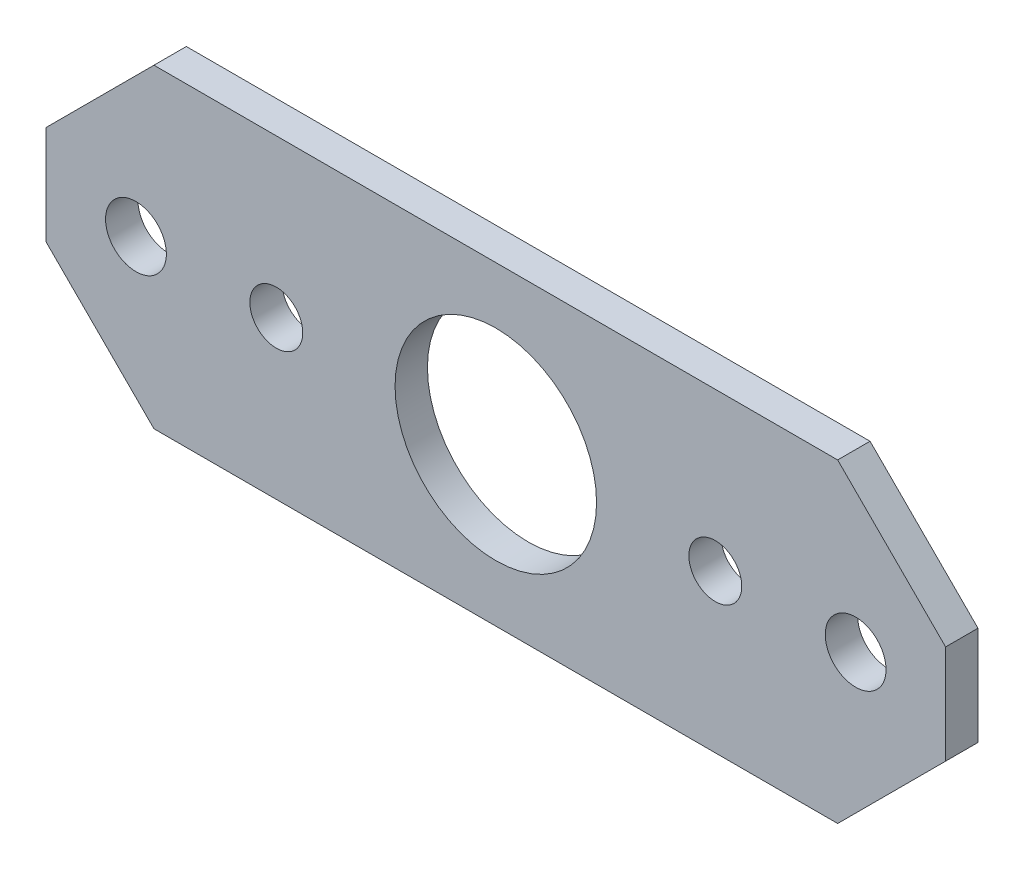
ISO-10303-21;
HEADER;
FILE_DESCRIPTION(('STEP AP214'),'2;1');
FILE_NAME('part.step','',(''),(''),'','','');
FILE_SCHEMA(('AUTOMOTIVE_DESIGN { 1 0 10303 214 1 1 1 1 }'));
ENDSEC;
DATA;
#1=APPLICATION_CONTEXT('core data for automotive mechanical design processes');
#2=APPLICATION_PROTOCOL_DEFINITION('international standard','automotive_design',2000,#1);
#3=PRODUCT_CONTEXT('',#1,'mechanical');
#4=PRODUCT('Part','Part','',(#3));
#5=PRODUCT_RELATED_PRODUCT_CATEGORY('part','',(#4));
#6=PRODUCT_DEFINITION_FORMATION('','',#4);
#7=PRODUCT_DEFINITION_CONTEXT('part definition',#1,'design');
#8=PRODUCT_DEFINITION('design','',#6,#7);
#9=PRODUCT_DEFINITION_SHAPE('','',#8);
#10=(LENGTH_UNIT() NAMED_UNIT(*) SI_UNIT(.MILLI.,.METRE.));
#11=(NAMED_UNIT(*) PLANE_ANGLE_UNIT() SI_UNIT($,.RADIAN.));
#12=(NAMED_UNIT(*) SI_UNIT($,.STERADIAN.) SOLID_ANGLE_UNIT());
#13=UNCERTAINTY_MEASURE_WITH_UNIT(LENGTH_MEASURE(1.E-05),#10,'distance_accuracy_value','');
#14=(GEOMETRIC_REPRESENTATION_CONTEXT(3) GLOBAL_UNCERTAINTY_ASSIGNED_CONTEXT((#13)) GLOBAL_UNIT_ASSIGNED_CONTEXT((#10,
#11,#12)) REPRESENTATION_CONTEXT('',''));
#15=CARTESIAN_POINT('',(0.,0.,0.));
#16=DIRECTION('',(0.,0.,1.));
#17=DIRECTION('',(1.,0.,0.));
#18=AXIS2_PLACEMENT_3D('',#15,#16,#17);
#19=CARTESIAN_POINT('',(-31.75,-11.1125,0.));
#20=DIRECTION('',(0.,0.,1.));
#21=DIRECTION('',(1.,0.,0.));
#22=AXIS2_PLACEMENT_3D('',#19,#20,#21);
#23=PLANE('',#22);
#24=DIRECTION('',(-0.707106781186548,0.707106781186548,0.));
#25=VECTOR('',#24,1.);
#26=CARTESIAN_POINT('',(-24.13,-11.1125,0.));
#27=LINE('',#26,#25);
#28=CARTESIAN_POINT('',(-24.13,-11.1125,0.));
#29=VERTEX_POINT('',#28);
#30=CARTESIAN_POINT('',(-31.75,-3.4925,0.));
#31=VERTEX_POINT('',#30);
#32=EDGE_CURVE('E82',#29,#31,#27,.T.);
#33=ORIENTED_EDGE('',*,*,#32,.T.);
#34=DIRECTION('',(0.,1.,0.));
#35=VECTOR('',#34,1.);
#36=CARTESIAN_POINT('',(-31.75,11.1125,0.));
#37=LINE('',#36,#35);
#38=CARTESIAN_POINT('',(-31.75,3.4925,0.));
#39=VERTEX_POINT('',#38);
#40=EDGE_CURVE('E85',#31,#39,#37,.T.);
#41=ORIENTED_EDGE('',*,*,#40,.T.);
#42=DIRECTION('',(0.707106781186547,0.707106781186548,0.));
#43=VECTOR('',#42,1.);
#44=CARTESIAN_POINT('',(-31.75,3.4925,0.));
#45=LINE('',#44,#43);
#46=CARTESIAN_POINT('',(-24.13,11.1125,0.));
#47=VERTEX_POINT('',#46);
#48=EDGE_CURVE('E349',#39,#47,#45,.T.);
#49=ORIENTED_EDGE('',*,*,#48,.T.);
#50=DIRECTION('',(1.,0.,0.));
#51=VECTOR('',#50,1.);
#52=CARTESIAN_POINT('',(-31.75,11.1125,0.));
#53=LINE('',#52,#51);
#54=CARTESIAN_POINT('',(24.13,11.1125,0.));
#55=VERTEX_POINT('',#54);
#56=EDGE_CURVE('E344',#47,#55,#53,.T.);
#57=ORIENTED_EDGE('',*,*,#56,.T.);
#58=DIRECTION('',(0.707106781186548,-0.707106781186547,0.));
#59=VECTOR('',#58,1.);
#60=CARTESIAN_POINT('',(24.13,11.1125,0.));
#61=LINE('',#60,#59);
#62=CARTESIAN_POINT('',(31.75,3.4925,0.));
#63=VERTEX_POINT('',#62);
#64=EDGE_CURVE('E340',#55,#63,#61,.T.);
#65=ORIENTED_EDGE('',*,*,#64,.T.);
#66=DIRECTION('',(0.,1.,0.));
#67=VECTOR('',#66,1.);
#68=CARTESIAN_POINT('',(31.75,11.1125,0.));
#69=LINE('',#68,#67);
#70=CARTESIAN_POINT('',(31.75,-3.4925,0.));
#71=VERTEX_POINT('',#70);
#72=EDGE_CURVE('E336',#63,#71,#69,.F.);
#73=ORIENTED_EDGE('',*,*,#72,.T.);
#74=DIRECTION('',(-0.707106781186548,-0.707106781186547,0.));
#75=VECTOR('',#74,1.);
#76=CARTESIAN_POINT('',(31.75,-3.4925,0.));
#77=LINE('',#76,#75);
#78=CARTESIAN_POINT('',(24.13,-11.1125,0.));
#79=VERTEX_POINT('',#78);
#80=EDGE_CURVE('E331',#71,#79,#77,.T.);
#81=ORIENTED_EDGE('',*,*,#80,.T.);
#82=DIRECTION('',(1.,0.,0.));
#83=VECTOR('',#82,1.);
#84=CARTESIAN_POINT('',(-31.75,-11.1125,0.));
#85=LINE('',#84,#83);
#86=EDGE_CURVE('E80',#79,#29,#85,.F.);
#87=ORIENTED_EDGE('',*,*,#86,.T.);
#88=EDGE_LOOP('',(#33,#41,#49,#57,#65,#73,#81,#87));
#89=FACE_BOUND('',#88,.T.);
#90=CARTESIAN_POINT('',(0.,0.,0.));
#91=DIRECTION('',(0.,0.,-1.));
#92=DIRECTION('',(-1.,0.,0.));
#93=AXIS2_PLACEMENT_3D('',#90,#91,#92);
#94=CIRCLE('',#93,7.112);
#95=CARTESIAN_POINT('',(-7.112,0.,0.));
#96=VERTEX_POINT('',#95);
#97=EDGE_CURVE('E98',#96,#96,#94,.F.);
#98=ORIENTED_EDGE('',*,*,#97,.T.);
#99=EDGE_LOOP('',(#98));
#100=FACE_BOUND('',#99,.T.);
#101=CARTESIAN_POINT('',(25.4,0.,0.));
#102=DIRECTION('',(0.,0.,-1.));
#103=DIRECTION('',(-1.,0.,0.));
#104=AXIS2_PLACEMENT_3D('',#101,#102,#103);
#105=CIRCLE('',#104,2.1463);
#106=CARTESIAN_POINT('',(23.2537,0.,0.));
#107=VERTEX_POINT('',#106);
#108=EDGE_CURVE('E127',#107,#107,#105,.F.);
#109=ORIENTED_EDGE('',*,*,#108,.T.);
#110=EDGE_LOOP('',(#109));
#111=FACE_BOUND('',#110,.T.);
#112=CARTESIAN_POINT('',(-25.4,0.,0.));
#113=DIRECTION('',(0.,0.,-1.));
#114=DIRECTION('',(-1.,0.,0.));
#115=AXIS2_PLACEMENT_3D('',#112,#113,#114);
#116=CIRCLE('',#115,2.1463);
#117=CARTESIAN_POINT('',(-27.5463,0.,0.));
#118=VERTEX_POINT('',#117);
#119=EDGE_CURVE('E130',#118,#118,#116,.F.);
#120=ORIENTED_EDGE('',*,*,#119,.T.);
#121=EDGE_LOOP('',(#120));
#122=FACE_BOUND('',#121,.T.);
#123=CARTESIAN_POINT('',(15.494,0.,0.));
#124=DIRECTION('',(0.,0.,-1.));
#125=DIRECTION('',(-1.,0.,0.));
#126=AXIS2_PLACEMENT_3D('',#123,#124,#125);
#127=CIRCLE('',#126,1.8669);
#128=CARTESIAN_POINT('',(13.6271,0.,0.));
#129=VERTEX_POINT('',#128);
#130=EDGE_CURVE('E132',#129,#129,#127,.F.);
#131=ORIENTED_EDGE('',*,*,#130,.T.);
#132=EDGE_LOOP('',(#131));
#133=FACE_BOUND('',#132,.T.);
#134=CARTESIAN_POINT('',(-15.494,0.,0.));
#135=DIRECTION('',(0.,0.,-1.));
#136=DIRECTION('',(-1.,0.,0.));
#137=AXIS2_PLACEMENT_3D('',#134,#135,#136);
#138=CIRCLE('',#137,1.8669);
#139=CARTESIAN_POINT('',(-17.3609,0.,0.));
#140=VERTEX_POINT('',#139);
#141=EDGE_CURVE('E20',#140,#140,#138,.F.);
#142=ORIENTED_EDGE('',*,*,#141,.T.);
#143=EDGE_LOOP('',(#142));
#144=FACE_BOUND('',#143,.T.);
#145=ADVANCED_FACE('F17',(#89,#100,#111,#122,#133,#144),#23,.F.);
#146=CARTESIAN_POINT('',(-15.494,0.,2.286));
#147=DIRECTION('',(0.,0.,-1.));
#148=DIRECTION('',(-1.,0.,0.));
#149=AXIS2_PLACEMENT_3D('',#146,#147,#148);
#150=CYLINDRICAL_SURFACE('',#149,1.8669);
#151=ORIENTED_EDGE('',*,*,#141,.F.);
#152=EDGE_LOOP('',(#151));
#153=FACE_BOUND('',#152,.T.);
#154=CARTESIAN_POINT('',(-15.494,0.,2.286));
#155=DIRECTION('',(0.,0.,-1.));
#156=DIRECTION('',(-1.,0.,0.));
#157=AXIS2_PLACEMENT_3D('',#154,#155,#156);
#158=CIRCLE('',#157,1.8669);
#159=CARTESIAN_POINT('',(-17.3609,0.,2.286));
#160=VERTEX_POINT('',#159);
#161=EDGE_CURVE('E122',#160,#160,#158,.T.);
#162=ORIENTED_EDGE('',*,*,#161,.F.);
#163=EDGE_LOOP('',(#162));
#164=FACE_BOUND('',#163,.T.);
#165=ADVANCED_FACE('F140',(#153,#164),#150,.F.);
#166=CARTESIAN_POINT('',(15.494,0.,2.286));
#167=DIRECTION('',(0.,0.,-1.));
#168=DIRECTION('',(-1.,0.,0.));
#169=AXIS2_PLACEMENT_3D('',#166,#167,#168);
#170=CYLINDRICAL_SURFACE('',#169,1.8669);
#171=ORIENTED_EDGE('',*,*,#130,.F.);
#172=EDGE_LOOP('',(#171));
#173=FACE_BOUND('',#172,.T.);
#174=CARTESIAN_POINT('',(15.494,0.,2.286));
#175=DIRECTION('',(0.,0.,-1.));
#176=DIRECTION('',(-1.,0.,0.));
#177=AXIS2_PLACEMENT_3D('',#174,#175,#176);
#178=CIRCLE('',#177,1.8669);
#179=CARTESIAN_POINT('',(13.6271,0.,2.286));
#180=VERTEX_POINT('',#179);
#181=EDGE_CURVE('E119',#180,#180,#178,.T.);
#182=ORIENTED_EDGE('',*,*,#181,.F.);
#183=EDGE_LOOP('',(#182));
#184=FACE_BOUND('',#183,.T.);
#185=ADVANCED_FACE('F143',(#173,#184),#170,.F.);
#186=CARTESIAN_POINT('',(-25.4,0.,2.286));
#187=DIRECTION('',(0.,0.,-1.));
#188=DIRECTION('',(-1.,0.,0.));
#189=AXIS2_PLACEMENT_3D('',#186,#187,#188);
#190=CYLINDRICAL_SURFACE('',#189,2.1463);
#191=ORIENTED_EDGE('',*,*,#119,.F.);
#192=EDGE_LOOP('',(#191));
#193=FACE_BOUND('',#192,.T.);
#194=CARTESIAN_POINT('',(-25.4,0.,2.286));
#195=DIRECTION('',(0.,0.,-1.));
#196=DIRECTION('',(-1.,0.,0.));
#197=AXIS2_PLACEMENT_3D('',#194,#195,#196);
#198=CIRCLE('',#197,2.1463);
#199=CARTESIAN_POINT('',(-27.5463,0.,2.286));
#200=VERTEX_POINT('',#199);
#201=EDGE_CURVE('E116',#200,#200,#198,.T.);
#202=ORIENTED_EDGE('',*,*,#201,.F.);
#203=EDGE_LOOP('',(#202));
#204=FACE_BOUND('',#203,.T.);
#205=ADVANCED_FACE('F190',(#193,#204),#190,.F.);
#206=CARTESIAN_POINT('',(25.4,0.,2.286));
#207=DIRECTION('',(0.,0.,-1.));
#208=DIRECTION('',(-1.,0.,0.));
#209=AXIS2_PLACEMENT_3D('',#206,#207,#208);
#210=CYLINDRICAL_SURFACE('',#209,2.1463);
#211=ORIENTED_EDGE('',*,*,#108,.F.);
#212=EDGE_LOOP('',(#211));
#213=FACE_BOUND('',#212,.T.);
#214=CARTESIAN_POINT('',(25.4,0.,2.286));
#215=DIRECTION('',(0.,0.,-1.));
#216=DIRECTION('',(-1.,0.,0.));
#217=AXIS2_PLACEMENT_3D('',#214,#215,#216);
#218=CIRCLE('',#217,2.1463);
#219=CARTESIAN_POINT('',(23.2537,0.,2.286));
#220=VERTEX_POINT('',#219);
#221=EDGE_CURVE('E113',#220,#220,#218,.T.);
#222=ORIENTED_EDGE('',*,*,#221,.F.);
#223=EDGE_LOOP('',(#222));
#224=FACE_BOUND('',#223,.T.);
#225=ADVANCED_FACE('F186',(#213,#224),#210,.F.);
#226=CARTESIAN_POINT('',(0.,0.,2.286));
#227=DIRECTION('',(0.,0.,-1.));
#228=DIRECTION('',(-1.,0.,0.));
#229=AXIS2_PLACEMENT_3D('',#226,#227,#228);
#230=CYLINDRICAL_SURFACE('',#229,7.112);
#231=ORIENTED_EDGE('',*,*,#97,.F.);
#232=EDGE_LOOP('',(#231));
#233=FACE_BOUND('',#232,.T.);
#234=CARTESIAN_POINT('',(0.,0.,2.286));
#235=DIRECTION('',(0.,0.,-1.));
#236=DIRECTION('',(-1.,0.,0.));
#237=AXIS2_PLACEMENT_3D('',#234,#235,#236);
#238=CIRCLE('',#237,7.112);
#239=CARTESIAN_POINT('',(-7.112,0.,2.286));
#240=VERTEX_POINT('',#239);
#241=EDGE_CURVE('E109',#240,#240,#238,.T.);
#242=ORIENTED_EDGE('',*,*,#241,.F.);
#243=EDGE_LOOP('',(#242));
#244=FACE_BOUND('',#243,.T.);
#245=ADVANCED_FACE('F183',(#233,#244),#230,.F.);
#246=CARTESIAN_POINT('',(-31.75,11.1125,2.286));
#247=DIRECTION('',(1.,0.,0.));
#248=DIRECTION('',(0.,0.,-1.));
#249=AXIS2_PLACEMENT_3D('',#246,#247,#248);
#250=PLANE('',#249);
#251=DIRECTION('',(0.,0.,1.));
#252=VECTOR('',#251,1.);
#253=CARTESIAN_POINT('',(-31.75,-3.4925,2.286));
#254=LINE('',#253,#252);
#255=CARTESIAN_POINT('',(-31.75,-3.4925,2.286));
#256=VERTEX_POINT('',#255);
#257=EDGE_CURVE('E90',#31,#256,#254,.T.);
#258=ORIENTED_EDGE('',*,*,#257,.T.);
#259=DIRECTION('',(0.,1.,0.));
#260=VECTOR('',#259,1.);
#261=CARTESIAN_POINT('',(-31.75,-11.1125,2.286));
#262=LINE('',#261,#260);
#263=CARTESIAN_POINT('',(-31.75,3.4925,2.286));
#264=VERTEX_POINT('',#263);
#265=EDGE_CURVE('E112',#264,#256,#262,.F.);
#266=ORIENTED_EDGE('',*,*,#265,.F.);
#267=DIRECTION('',(0.,0.,1.));
#268=VECTOR('',#267,1.);
#269=CARTESIAN_POINT('',(-31.75,3.4925,2.286));
#270=LINE('',#269,#268);
#271=EDGE_CURVE('E96',#264,#39,#270,.F.);
#272=ORIENTED_EDGE('',*,*,#271,.T.);
#273=ORIENTED_EDGE('',*,*,#40,.F.);
#274=EDGE_LOOP('',(#258,#266,#272,#273));
#275=FACE_BOUND('',#274,.T.);
#276=ADVANCED_FACE('F93',(#275),#250,.F.);
#277=CARTESIAN_POINT('',(-24.13,-11.1125,2.286));
#278=DIRECTION('',(0.707106781186548,0.707106781186548,0.));
#279=DIRECTION('',(-0.707106781186548,0.707106781186548,0.));
#280=AXIS2_PLACEMENT_3D('',#277,#278,#279);
#281=PLANE('',#280);
#282=ORIENTED_EDGE('',*,*,#257,.F.);
#283=ORIENTED_EDGE('',*,*,#32,.F.);
#284=DIRECTION('',(0.,0.,1.));
#285=VECTOR('',#284,1.);
#286=CARTESIAN_POINT('',(-24.13,-11.1125,2.286));
#287=LINE('',#286,#285);
#288=CARTESIAN_POINT('',(-24.13,-11.1125,2.286));
#289=VERTEX_POINT('',#288);
#290=EDGE_CURVE('E105',#29,#289,#287,.T.);
#291=ORIENTED_EDGE('',*,*,#290,.T.);
#292=DIRECTION('',(0.707106781186547,-0.707106781186548,0.));
#293=VECTOR('',#292,1.);
#294=CARTESIAN_POINT('',(-31.75,-3.49249999999999,2.286));
#295=LINE('',#294,#293);
#296=EDGE_CURVE('E102',#256,#289,#295,.T.);
#297=ORIENTED_EDGE('',*,*,#296,.F.);
#298=EDGE_LOOP('',(#282,#283,#291,#297));
#299=FACE_BOUND('',#298,.T.);
#300=ADVANCED_FACE('F100',(#299),#281,.F.);
#301=CARTESIAN_POINT('',(-31.75,-11.1125,2.286));
#302=DIRECTION('',(0.,1.,0.));
#303=DIRECTION('',(0.,0.,1.));
#304=AXIS2_PLACEMENT_3D('',#301,#302,#303);
#305=PLANE('',#304);
#306=ORIENTED_EDGE('',*,*,#290,.F.);
#307=ORIENTED_EDGE('',*,*,#86,.F.);
#308=DIRECTION('',(0.,0.,1.));
#309=VECTOR('',#308,1.);
#310=CARTESIAN_POINT('',(24.13,-11.1125,2.286));
#311=LINE('',#310,#309);
#312=CARTESIAN_POINT('',(24.13,-11.1125,2.286));
#313=VERTEX_POINT('',#312);
#314=EDGE_CURVE('E332',#79,#313,#311,.T.);
#315=ORIENTED_EDGE('',*,*,#314,.T.);
#316=DIRECTION('',(1.,0.,0.));
#317=VECTOR('',#316,1.);
#318=CARTESIAN_POINT('',(-31.75,-11.1125,2.286));
#319=LINE('',#318,#317);
#320=EDGE_CURVE('E330',#289,#313,#319,.T.);
#321=ORIENTED_EDGE('',*,*,#320,.F.);
#322=EDGE_LOOP('',(#306,#307,#315,#321));
#323=FACE_BOUND('',#322,.T.);
#324=ADVANCED_FACE('F174',(#323),#305,.F.);
#325=CARTESIAN_POINT('',(31.75,-3.4925,2.286));
#326=DIRECTION('',(-0.707106781186547,0.707106781186548,0.));
#327=DIRECTION('',(-0.707106781186548,-0.707106781186547,0.));
#328=AXIS2_PLACEMENT_3D('',#325,#326,#327);
#329=PLANE('',#328);
#330=ORIENTED_EDGE('',*,*,#314,.F.);
#331=ORIENTED_EDGE('',*,*,#80,.F.);
#332=DIRECTION('',(0.,0.,1.));
#333=VECTOR('',#332,1.);
#334=CARTESIAN_POINT('',(31.75,-3.4925,2.286));
#335=LINE('',#334,#333);
#336=CARTESIAN_POINT('',(31.75,-3.4925,2.286));
#337=VERTEX_POINT('',#336);
#338=EDGE_CURVE('E338',#71,#337,#335,.T.);
#339=ORIENTED_EDGE('',*,*,#338,.T.);
#340=DIRECTION('',(0.707106781186548,0.707106781186547,0.));
#341=VECTOR('',#340,1.);
#342=CARTESIAN_POINT('',(24.13,-11.1125,2.286));
#343=LINE('',#342,#341);
#344=EDGE_CURVE('E355',#313,#337,#343,.T.);
#345=ORIENTED_EDGE('',*,*,#344,.F.);
#346=EDGE_LOOP('',(#330,#331,#339,#345));
#347=FACE_BOUND('',#346,.T.);
#348=ADVANCED_FACE('F170',(#347),#329,.F.);
#349=CARTESIAN_POINT('',(31.75,11.1125,2.286));
#350=DIRECTION('',(-1.,0.,0.));
#351=DIRECTION('',(0.,0.,1.));
#352=AXIS2_PLACEMENT_3D('',#349,#350,#351);
#353=PLANE('',#352);
#354=ORIENTED_EDGE('',*,*,#338,.F.);
#355=ORIENTED_EDGE('',*,*,#72,.F.);
#356=DIRECTION('',(0.,0.,1.));
#357=VECTOR('',#356,1.);
#358=CARTESIAN_POINT('',(31.75,3.4925,2.286));
#359=LINE('',#358,#357);
#360=CARTESIAN_POINT('',(31.75,3.4925,2.286));
#361=VERTEX_POINT('',#360);
#362=EDGE_CURVE('E342',#63,#361,#359,.T.);
#363=ORIENTED_EDGE('',*,*,#362,.T.);
#364=DIRECTION('',(0.,1.,0.));
#365=VECTOR('',#364,1.);
#366=CARTESIAN_POINT('',(31.75,-11.1125,2.286));
#367=LINE('',#366,#365);
#368=EDGE_CURVE('E358',#337,#361,#367,.T.);
#369=ORIENTED_EDGE('',*,*,#368,.F.);
#370=EDGE_LOOP('',(#354,#355,#363,#369));
#371=FACE_BOUND('',#370,.T.);
#372=ADVANCED_FACE('F166',(#371),#353,.F.);
#373=CARTESIAN_POINT('',(24.13,11.1125,2.286));
#374=DIRECTION('',(-0.707106781186547,-0.707106781186548,0.));
#375=DIRECTION('',(0.707106781186548,-0.707106781186547,0.));
#376=AXIS2_PLACEMENT_3D('',#373,#374,#375);
#377=PLANE('',#376);
#378=ORIENTED_EDGE('',*,*,#362,.F.);
#379=ORIENTED_EDGE('',*,*,#64,.F.);
#380=DIRECTION('',(0.,0.,-1.));
#381=VECTOR('',#380,1.);
#382=CARTESIAN_POINT('',(24.13,11.1125,2.286));
#383=LINE('',#382,#381);
#384=CARTESIAN_POINT('',(24.13,11.1125,2.286));
#385=VERTEX_POINT('',#384);
#386=EDGE_CURVE('E346',#55,#385,#383,.F.);
#387=ORIENTED_EDGE('',*,*,#386,.T.);
#388=DIRECTION('',(-0.707106781186547,0.707106781186547,0.));
#389=VECTOR('',#388,1.);
#390=CARTESIAN_POINT('',(31.75,3.49249999999999,2.286));
#391=LINE('',#390,#389);
#392=EDGE_CURVE('E361',#361,#385,#391,.T.);
#393=ORIENTED_EDGE('',*,*,#392,.F.);
#394=EDGE_LOOP('',(#378,#379,#387,#393));
#395=FACE_BOUND('',#394,.T.);
#396=ADVANCED_FACE('F163',(#395),#377,.F.);
#397=CARTESIAN_POINT('',(-31.75,11.1125,2.286));
#398=DIRECTION('',(0.,-1.,0.));
#399=DIRECTION('',(0.,0.,-1.));
#400=AXIS2_PLACEMENT_3D('',#397,#398,#399);
#401=PLANE('',#400);
#402=ORIENTED_EDGE('',*,*,#386,.F.);
#403=ORIENTED_EDGE('',*,*,#56,.F.);
#404=DIRECTION('',(0.,0.,1.));
#405=VECTOR('',#404,1.);
#406=CARTESIAN_POINT('',(-24.13,11.1125,2.286));
#407=LINE('',#406,#405);
#408=CARTESIAN_POINT('',(-24.13,11.1125,2.286));
#409=VERTEX_POINT('',#408);
#410=EDGE_CURVE('E35',#47,#409,#407,.T.);
#411=ORIENTED_EDGE('',*,*,#410,.T.);
#412=DIRECTION('',(1.,0.,0.));
#413=VECTOR('',#412,1.);
#414=CARTESIAN_POINT('',(-31.75,11.1125,2.286));
#415=LINE('',#414,#413);
#416=EDGE_CURVE('E26',#385,#409,#415,.F.);
#417=ORIENTED_EDGE('',*,*,#416,.F.);
#418=EDGE_LOOP('',(#402,#403,#411,#417));
#419=FACE_BOUND('',#418,.T.);
#420=ADVANCED_FACE('F155',(#419),#401,.F.);
#421=CARTESIAN_POINT('',(-31.75,3.4925,2.286));
#422=DIRECTION('',(0.707106781186548,-0.707106781186547,0.));
#423=DIRECTION('',(0.707106781186547,0.707106781186548,0.));
#424=AXIS2_PLACEMENT_3D('',#421,#422,#423);
#425=PLANE('',#424);
#426=ORIENTED_EDGE('',*,*,#410,.F.);
#427=ORIENTED_EDGE('',*,*,#48,.F.);
#428=ORIENTED_EDGE('',*,*,#271,.F.);
#429=DIRECTION('',(-0.707106781186547,-0.707106781186548,0.));
#430=VECTOR('',#429,1.);
#431=CARTESIAN_POINT('',(-24.13,11.1125,2.286));
#432=LINE('',#431,#430);
#433=EDGE_CURVE('E11',#409,#264,#432,.T.);
#434=ORIENTED_EDGE('',*,*,#433,.F.);
#435=EDGE_LOOP('',(#426,#427,#428,#434));
#436=FACE_BOUND('',#435,.T.);
#437=ADVANCED_FACE('F148',(#436),#425,.F.);
#438=CARTESIAN_POINT('',(-31.75,-11.1125,2.286));
#439=DIRECTION('',(0.,0.,1.));
#440=DIRECTION('',(1.,0.,0.));
#441=AXIS2_PLACEMENT_3D('',#438,#439,#440);
#442=PLANE('',#441);
#443=ORIENTED_EDGE('',*,*,#416,.T.);
#444=ORIENTED_EDGE('',*,*,#433,.T.);
#445=ORIENTED_EDGE('',*,*,#265,.T.);
#446=ORIENTED_EDGE('',*,*,#296,.T.);
#447=ORIENTED_EDGE('',*,*,#320,.T.);
#448=ORIENTED_EDGE('',*,*,#344,.T.);
#449=ORIENTED_EDGE('',*,*,#368,.T.);
#450=ORIENTED_EDGE('',*,*,#392,.T.);
#451=EDGE_LOOP('',(#443,#444,#445,#446,#447,#448,#449,#450));
#452=FACE_BOUND('',#451,.T.);
#453=ORIENTED_EDGE('',*,*,#241,.T.);
#454=EDGE_LOOP('',(#453));
#455=FACE_BOUND('',#454,.T.);
#456=ORIENTED_EDGE('',*,*,#221,.T.);
#457=EDGE_LOOP('',(#456));
#458=FACE_BOUND('',#457,.T.);
#459=ORIENTED_EDGE('',*,*,#201,.T.);
#460=EDGE_LOOP('',(#459));
#461=FACE_BOUND('',#460,.T.);
#462=ORIENTED_EDGE('',*,*,#181,.T.);
#463=EDGE_LOOP('',(#462));
#464=FACE_BOUND('',#463,.T.);
#465=ORIENTED_EDGE('',*,*,#161,.T.);
#466=EDGE_LOOP('',(#465));
#467=FACE_BOUND('',#466,.T.);
#468=ADVANCED_FACE('F146',(#452,#455,#458,#461,#464,#467),#442,.T.);
#469=CLOSED_SHELL('',(#145,#165,#185,#205,#225,#245,#276,#300,#324,#348,#372,#396,#420,#437,#468));
#470=MANIFOLD_SOLID_BREP('B1',#469);
#471=ADVANCED_BREP_SHAPE_REPRESENTATION('',(#18,#470),#14);
#472=SHAPE_DEFINITION_REPRESENTATION(#9,#471);
ENDSEC;
END-ISO-10303-21;
